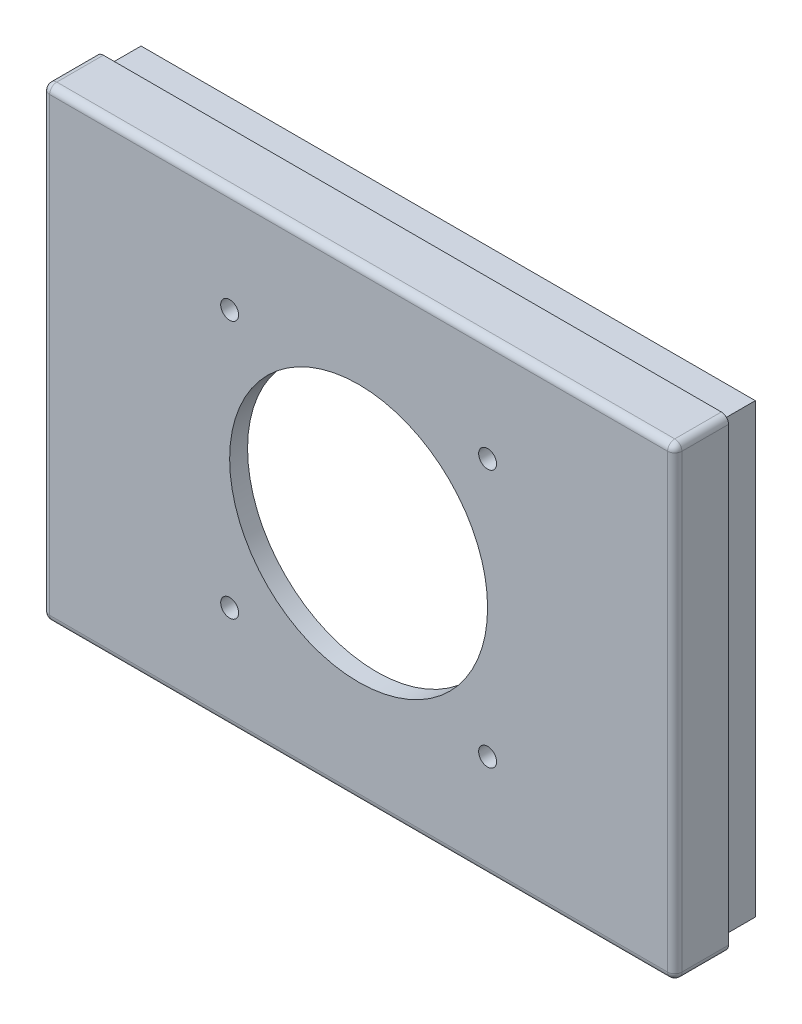
ISO-10303-21;
HEADER;
FILE_DESCRIPTION(('STEP AP214'),'2;1');
FILE_NAME('part.step','',(''),(''),'','','');
FILE_SCHEMA(('AUTOMOTIVE_DESIGN { 1 0 10303 214 1 1 1 1 }'));
ENDSEC;
DATA;
#1=APPLICATION_CONTEXT('core data for automotive mechanical design processes');
#2=APPLICATION_PROTOCOL_DEFINITION('international standard','automotive_design',2000,#1);
#3=PRODUCT_CONTEXT('',#1,'mechanical');
#4=PRODUCT('Part','Part','',(#3));
#5=PRODUCT_RELATED_PRODUCT_CATEGORY('part','',(#4));
#6=PRODUCT_DEFINITION_FORMATION('','',#4);
#7=PRODUCT_DEFINITION_CONTEXT('part definition',#1,'design');
#8=PRODUCT_DEFINITION('design','',#6,#7);
#9=PRODUCT_DEFINITION_SHAPE('','',#8);
#10=(LENGTH_UNIT() NAMED_UNIT(*) SI_UNIT(.MILLI.,.METRE.));
#11=(NAMED_UNIT(*) PLANE_ANGLE_UNIT() SI_UNIT($,.RADIAN.));
#12=(NAMED_UNIT(*) SI_UNIT($,.STERADIAN.) SOLID_ANGLE_UNIT());
#13=UNCERTAINTY_MEASURE_WITH_UNIT(LENGTH_MEASURE(1.E-05),#10,'distance_accuracy_value','');
#14=(GEOMETRIC_REPRESENTATION_CONTEXT(3) GLOBAL_UNCERTAINTY_ASSIGNED_CONTEXT((#13)) GLOBAL_UNIT_ASSIGNED_CONTEXT((#10,
#11,#12)) REPRESENTATION_CONTEXT('',''));
#15=CARTESIAN_POINT('',(0.,0.,0.));
#16=DIRECTION('',(0.,0.,1.));
#17=DIRECTION('',(1.,0.,0.));
#18=AXIS2_PLACEMENT_3D('',#15,#16,#17);
#19=CARTESIAN_POINT('',(0.,0.,10.));
#20=DIRECTION('',(0.,0.,1.));
#21=DIRECTION('',(1.,0.,0.));
#22=AXIS2_PLACEMENT_3D('',#19,#20,#21);
#23=PLANE('',#22);
#24=DIRECTION('',(0.,-1.,0.));
#25=VECTOR('',#24,1.);
#26=CARTESIAN_POINT('',(146.492,99.883,10.));
#27=LINE('',#26,#25);
#28=CARTESIAN_POINT('',(146.492,99.883,10.));
#29=VERTEX_POINT('',#28);
#30=CARTESIAN_POINT('',(146.492,-20.,10.));
#31=VERTEX_POINT('',#30);
#32=EDGE_CURVE('E235',#29,#31,#27,.T.);
#33=ORIENTED_EDGE('',*,*,#32,.F.);
#34=DIRECTION('',(1.,0.,0.));
#35=VECTOR('',#34,1.);
#36=CARTESIAN_POINT('',(146.492,99.883,10.));
#37=LINE('',#36,#35);
#38=CARTESIAN_POINT('',(-20.,99.883,10.));
#39=VERTEX_POINT('',#38);
#40=EDGE_CURVE('E219',#39,#29,#37,.T.);
#41=ORIENTED_EDGE('',*,*,#40,.F.);
#42=DIRECTION('',(0.,1.,0.));
#43=VECTOR('',#42,1.);
#44=CARTESIAN_POINT('',(-20.,99.883,10.));
#45=LINE('',#44,#43);
#46=CARTESIAN_POINT('',(-20.,-20.,10.));
#47=VERTEX_POINT('',#46);
#48=EDGE_CURVE('E224',#47,#39,#45,.T.);
#49=ORIENTED_EDGE('',*,*,#48,.F.);
#50=DIRECTION('',(-1.,0.,0.));
#51=VECTOR('',#50,1.);
#52=CARTESIAN_POINT('',(146.492,-20.,10.));
#53=LINE('',#52,#51);
#54=EDGE_CURVE('E238',#31,#47,#53,.T.);
#55=ORIENTED_EDGE('',*,*,#54,.F.);
#56=EDGE_LOOP('',(#33,#41,#49,#55));
#57=FACE_BOUND('',#56,.T.);
#58=DIRECTION('',(1.,0.,0.));
#59=VECTOR('',#58,1.);
#60=CARTESIAN_POINT('',(148.972,102.363,10.));
#61=LINE('',#60,#59);
#62=CARTESIAN_POINT('',(-22.48,102.363,10.));
#63=VERTEX_POINT('',#62);
#64=CARTESIAN_POINT('',(148.972,102.363,10.));
#65=VERTEX_POINT('',#64);
#66=EDGE_CURVE('E198',#63,#65,#61,.T.);
#67=ORIENTED_EDGE('',*,*,#66,.T.);
#68=DIRECTION('',(0.,-1.,0.));
#69=VECTOR('',#68,1.);
#70=CARTESIAN_POINT('',(148.972,102.363,10.));
#71=LINE('',#70,#69);
#72=CARTESIAN_POINT('',(148.972,-22.48,10.));
#73=VERTEX_POINT('',#72);
#74=EDGE_CURVE('E166',#65,#73,#71,.T.);
#75=ORIENTED_EDGE('',*,*,#74,.T.);
#76=DIRECTION('',(-1.,0.,0.));
#77=VECTOR('',#76,1.);
#78=CARTESIAN_POINT('',(148.972,-22.48,10.));
#79=LINE('',#78,#77);
#80=CARTESIAN_POINT('',(-22.48,-22.48,10.));
#81=VERTEX_POINT('',#80);
#82=EDGE_CURVE('E190',#73,#81,#79,.T.);
#83=ORIENTED_EDGE('',*,*,#82,.T.);
#84=DIRECTION('',(0.,1.,0.));
#85=VECTOR('',#84,1.);
#86=CARTESIAN_POINT('',(-22.48,102.363,10.));
#87=LINE('',#86,#85);
#88=EDGE_CURVE('E187',#81,#63,#87,.T.);
#89=ORIENTED_EDGE('',*,*,#88,.T.);
#90=EDGE_LOOP('',(#67,#75,#83,#89));
#91=FACE_BOUND('',#90,.T.);
#92=ADVANCED_FACE('F37',(#57,#91),#23,.F.);
#93=CARTESIAN_POINT('',(146.492,99.883,30.));
#94=DIRECTION('',(0.,1.,0.));
#95=DIRECTION('',(0.,0.,1.));
#96=AXIS2_PLACEMENT_3D('',#93,#94,#95);
#97=PLANE('',#96);
#98=ORIENTED_EDGE('',*,*,#40,.T.);
#99=DIRECTION('',(0.,0.,-1.));
#100=VECTOR('',#99,1.);
#101=CARTESIAN_POINT('',(146.492,99.883,30.));
#102=LINE('',#101,#100);
#103=CARTESIAN_POINT('',(146.492,99.883,30.));
#104=VERTEX_POINT('',#103);
#105=EDGE_CURVE('E233',#104,#29,#102,.T.);
#106=ORIENTED_EDGE('',*,*,#105,.F.);
#107=DIRECTION('',(1.,0.,0.));
#108=VECTOR('',#107,1.);
#109=CARTESIAN_POINT('',(146.492,99.883,30.));
#110=LINE('',#109,#108);
#111=CARTESIAN_POINT('',(-20.,99.883,30.));
#112=VERTEX_POINT('',#111);
#113=EDGE_CURVE('E220',#112,#104,#110,.T.);
#114=ORIENTED_EDGE('',*,*,#113,.F.);
#115=DIRECTION('',(0.,0.,-1.));
#116=VECTOR('',#115,1.);
#117=CARTESIAN_POINT('',(-20.,99.883,30.));
#118=LINE('',#117,#116);
#119=EDGE_CURVE('E243',#112,#39,#118,.T.);
#120=ORIENTED_EDGE('',*,*,#119,.T.);
#121=EDGE_LOOP('',(#98,#106,#114,#120));
#122=FACE_BOUND('',#121,.T.);
#123=ADVANCED_FACE('F377',(#122),#97,.F.);
#124=CARTESIAN_POINT('',(-20.,99.883,30.));
#125=DIRECTION('',(-1.,0.,0.));
#126=DIRECTION('',(0.,-1.,0.));
#127=AXIS2_PLACEMENT_3D('',#124,#125,#126);
#128=PLANE('',#127);
#129=ORIENTED_EDGE('',*,*,#48,.T.);
#130=ORIENTED_EDGE('',*,*,#119,.F.);
#131=DIRECTION('',(0.,1.,0.));
#132=VECTOR('',#131,1.);
#133=CARTESIAN_POINT('',(-20.,99.883,30.));
#134=LINE('',#133,#132);
#135=CARTESIAN_POINT('',(-20.,-20.,30.));
#136=VERTEX_POINT('',#135);
#137=EDGE_CURVE('E230',#136,#112,#134,.T.);
#138=ORIENTED_EDGE('',*,*,#137,.F.);
#139=DIRECTION('',(0.,0.,-1.));
#140=VECTOR('',#139,1.);
#141=CARTESIAN_POINT('',(-20.,-20.,30.));
#142=LINE('',#141,#140);
#143=EDGE_CURVE('E246',#136,#47,#142,.T.);
#144=ORIENTED_EDGE('',*,*,#143,.T.);
#145=EDGE_LOOP('',(#129,#130,#138,#144));
#146=FACE_BOUND('',#145,.T.);
#147=ADVANCED_FACE('F385',(#146),#128,.F.);
#148=CARTESIAN_POINT('',(146.492,-20.,30.));
#149=DIRECTION('',(0.,-1.,0.));
#150=DIRECTION('',(1.,0.,0.));
#151=AXIS2_PLACEMENT_3D('',#148,#149,#150);
#152=PLANE('',#151);
#153=ORIENTED_EDGE('',*,*,#54,.T.);
#154=ORIENTED_EDGE('',*,*,#143,.F.);
#155=DIRECTION('',(-1.,0.,0.));
#156=VECTOR('',#155,1.);
#157=CARTESIAN_POINT('',(146.492,-20.,30.));
#158=LINE('',#157,#156);
#159=CARTESIAN_POINT('',(146.492,-20.,30.));
#160=VERTEX_POINT('',#159);
#161=EDGE_CURVE('E227',#160,#136,#158,.T.);
#162=ORIENTED_EDGE('',*,*,#161,.F.);
#163=DIRECTION('',(0.,0.,-1.));
#164=VECTOR('',#163,1.);
#165=CARTESIAN_POINT('',(146.492,-20.,30.));
#166=LINE('',#165,#164);
#167=EDGE_CURVE('E248',#160,#31,#166,.T.);
#168=ORIENTED_EDGE('',*,*,#167,.T.);
#169=EDGE_LOOP('',(#153,#154,#162,#168));
#170=FACE_BOUND('',#169,.T.);
#171=ADVANCED_FACE('F501',(#170),#152,.F.);
#172=CARTESIAN_POINT('',(146.492,99.883,30.));
#173=DIRECTION('',(1.,0.,0.));
#174=DIRECTION('',(0.,0.,-1.));
#175=AXIS2_PLACEMENT_3D('',#172,#173,#174);
#176=PLANE('',#175);
#177=ORIENTED_EDGE('',*,*,#32,.T.);
#178=ORIENTED_EDGE('',*,*,#167,.F.);
#179=DIRECTION('',(0.,-1.,0.));
#180=VECTOR('',#179,1.);
#181=CARTESIAN_POINT('',(146.492,99.883,30.));
#182=LINE('',#181,#180);
#183=EDGE_CURVE('E223',#104,#160,#182,.T.);
#184=ORIENTED_EDGE('',*,*,#183,.F.);
#185=ORIENTED_EDGE('',*,*,#105,.T.);
#186=EDGE_LOOP('',(#177,#178,#184,#185));
#187=FACE_BOUND('',#186,.T.);
#188=ADVANCED_FACE('F493',(#187),#176,.F.);
#189=CARTESIAN_POINT('',(0.,0.,30.));
#190=DIRECTION('',(0.,0.,1.));
#191=DIRECTION('',(1.,0.,0.));
#192=AXIS2_PLACEMENT_3D('',#189,#190,#191);
#193=PLANE('',#192);
#194=CARTESIAN_POINT('',(27.2460000000007,3.94150000000001,30.));
#195=DIRECTION('',(0.,0.,1.));
#196=DIRECTION('',(1.,0.,0.));
#197=AXIS2_PLACEMENT_3D('',#194,#195,#196);
#198=CIRCLE('',#197,2.5);
#199=CARTESIAN_POINT('',(29.7460000000007,3.94150000000001,30.));
#200=VERTEX_POINT('',#199);
#201=EDGE_CURVE('E347',#200,#200,#198,.T.);
#202=ORIENTED_EDGE('',*,*,#201,.T.);
#203=EDGE_LOOP('',(#202));
#204=FACE_BOUND('',#203,.T.);
#205=CARTESIAN_POINT('',(99.2460000000007,3.94150000000101,30.));
#206=DIRECTION('',(0.,0.,1.));
#207=DIRECTION('',(1.,0.,0.));
#208=AXIS2_PLACEMENT_3D('',#205,#206,#207);
#209=CIRCLE('',#208,2.5);
#210=CARTESIAN_POINT('',(101.746000000001,3.94150000000101,30.));
#211=VERTEX_POINT('',#210);
#212=EDGE_CURVE('E344',#211,#211,#209,.T.);
#213=ORIENTED_EDGE('',*,*,#212,.T.);
#214=EDGE_LOOP('',(#213));
#215=FACE_BOUND('',#214,.T.);
#216=CARTESIAN_POINT('',(99.246,75.941500000001,30.));
#217=DIRECTION('',(0.,0.,1.));
#218=DIRECTION('',(1.,0.,0.));
#219=AXIS2_PLACEMENT_3D('',#216,#217,#218);
#220=CIRCLE('',#219,2.5);
#221=CARTESIAN_POINT('',(101.746,75.941500000001,30.));
#222=VERTEX_POINT('',#221);
#223=EDGE_CURVE('E341',#222,#222,#220,.T.);
#224=ORIENTED_EDGE('',*,*,#223,.T.);
#225=EDGE_LOOP('',(#224));
#226=FACE_BOUND('',#225,.T.);
#227=CARTESIAN_POINT('',(27.246,75.9415,30.));
#228=DIRECTION('',(0.,0.,1.));
#229=DIRECTION('',(1.,0.,0.));
#230=AXIS2_PLACEMENT_3D('',#227,#228,#229);
#231=CIRCLE('',#230,2.5);
#232=CARTESIAN_POINT('',(29.746,75.9415,30.));
#233=VERTEX_POINT('',#232);
#234=EDGE_CURVE('E338',#233,#233,#231,.T.);
#235=ORIENTED_EDGE('',*,*,#234,.T.);
#236=EDGE_LOOP('',(#235));
#237=FACE_BOUND('',#236,.T.);
#238=CARTESIAN_POINT('',(63.246,39.9415,30.));
#239=DIRECTION('',(0.,0.,1.));
#240=DIRECTION('',(1.,0.,0.));
#241=AXIS2_PLACEMENT_3D('',#238,#239,#240);
#242=CIRCLE('',#241,36.);
#243=CARTESIAN_POINT('',(99.246,39.9415,30.));
#244=VERTEX_POINT('',#243);
#245=EDGE_CURVE('E193',#244,#244,#242,.T.);
#246=ORIENTED_EDGE('',*,*,#245,.T.);
#247=EDGE_LOOP('',(#246));
#248=FACE_BOUND('',#247,.T.);
#249=ORIENTED_EDGE('',*,*,#113,.T.);
#250=ORIENTED_EDGE('',*,*,#183,.T.);
#251=ORIENTED_EDGE('',*,*,#161,.T.);
#252=ORIENTED_EDGE('',*,*,#137,.T.);
#253=EDGE_LOOP('',(#249,#250,#251,#252));
#254=FACE_BOUND('',#253,.T.);
#255=ADVANCED_FACE('F356',(#204,#215,#226,#237,#248,#254),#193,.F.);
#256=CARTESIAN_POINT('',(0.,0.,20.));
#257=DIRECTION('',(0.,0.,-1.));
#258=DIRECTION('',(-1.,0.,0.));
#259=AXIS2_PLACEMENT_3D('',#256,#257,#258);
#260=PLANE('',#259);
#261=DIRECTION('',(0.,1.,0.));
#262=VECTOR('',#261,1.);
#263=CARTESIAN_POINT('',(-22.48,102.363,20.));
#264=LINE('',#263,#262);
#265=CARTESIAN_POINT('',(-22.48,-22.48,20.));
#266=VERTEX_POINT('',#265);
#267=CARTESIAN_POINT('',(-22.48,102.363,20.));
#268=VERTEX_POINT('',#267);
#269=EDGE_CURVE('E172',#266,#268,#264,.T.);
#270=ORIENTED_EDGE('',*,*,#269,.F.);
#271=DIRECTION('',(-1.,0.,0.));
#272=VECTOR('',#271,1.);
#273=CARTESIAN_POINT('',(148.972,-22.48,20.));
#274=LINE('',#273,#272);
#275=CARTESIAN_POINT('',(148.972,-22.48,20.));
#276=VERTEX_POINT('',#275);
#277=EDGE_CURVE('E182',#276,#266,#274,.T.);
#278=ORIENTED_EDGE('',*,*,#277,.F.);
#279=DIRECTION('',(0.,-1.,0.));
#280=VECTOR('',#279,1.);
#281=CARTESIAN_POINT('',(148.972,102.363,20.));
#282=LINE('',#281,#280);
#283=CARTESIAN_POINT('',(148.972,102.363,20.));
#284=VERTEX_POINT('',#283);
#285=EDGE_CURVE('E164',#284,#276,#282,.T.);
#286=ORIENTED_EDGE('',*,*,#285,.F.);
#287=DIRECTION('',(1.,0.,0.));
#288=VECTOR('',#287,1.);
#289=CARTESIAN_POINT('',(148.972,102.363,20.));
#290=LINE('',#289,#288);
#291=EDGE_CURVE('E179',#268,#284,#290,.T.);
#292=ORIENTED_EDGE('',*,*,#291,.F.);
#293=EDGE_LOOP('',(#270,#278,#286,#292));
#294=FACE_BOUND('',#293,.T.);
#295=DIRECTION('',(0.,1.,0.));
#296=VECTOR('',#295,1.);
#297=CARTESIAN_POINT('',(-25.,104.883,20.));
#298=LINE('',#297,#296);
#299=CARTESIAN_POINT('',(-25.,-23.,20.));
#300=VERTEX_POINT('',#299);
#301=CARTESIAN_POINT('',(-25.,102.883,20.));
#302=VERTEX_POINT('',#301);
#303=EDGE_CURVE('E213',#300,#302,#298,.T.);
#304=ORIENTED_EDGE('',*,*,#303,.T.);
#305=CARTESIAN_POINT('',(-23.,102.883,20.));
#306=DIRECTION('',(0.,0.,-1.));
#307=DIRECTION('',(-1.,0.,0.));
#308=AXIS2_PLACEMENT_3D('',#305,#306,#307);
#309=CIRCLE('',#308,2.);
#310=CARTESIAN_POINT('',(-23.,104.883,20.));
#311=VERTEX_POINT('',#310);
#312=EDGE_CURVE('E279',#302,#311,#309,.T.);
#313=ORIENTED_EDGE('',*,*,#312,.T.);
#314=DIRECTION('',(1.,0.,0.));
#315=VECTOR('',#314,1.);
#316=CARTESIAN_POINT('',(151.492,104.883,20.));
#317=LINE('',#316,#315);
#318=CARTESIAN_POINT('',(149.492,104.883,20.));
#319=VERTEX_POINT('',#318);
#320=EDGE_CURVE('E216',#311,#319,#317,.T.);
#321=ORIENTED_EDGE('',*,*,#320,.T.);
#322=CARTESIAN_POINT('',(149.492,102.883,20.));
#323=DIRECTION('',(0.,0.,-1.));
#324=DIRECTION('',(-1.,0.,0.));
#325=AXIS2_PLACEMENT_3D('',#322,#323,#324);
#326=CIRCLE('',#325,2.);
#327=CARTESIAN_POINT('',(151.492,102.883,20.));
#328=VERTEX_POINT('',#327);
#329=EDGE_CURVE('E277',#319,#328,#326,.T.);
#330=ORIENTED_EDGE('',*,*,#329,.T.);
#331=DIRECTION('',(0.,-1.,0.));
#332=VECTOR('',#331,1.);
#333=CARTESIAN_POINT('',(151.492,104.883,20.));
#334=LINE('',#333,#332);
#335=CARTESIAN_POINT('',(151.492,-23.,20.));
#336=VERTEX_POINT('',#335);
#337=EDGE_CURVE('E204',#328,#336,#334,.T.);
#338=ORIENTED_EDGE('',*,*,#337,.T.);
#339=CARTESIAN_POINT('',(149.492,-23.,20.));
#340=DIRECTION('',(0.,0.,-1.));
#341=DIRECTION('',(-1.,0.,0.));
#342=AXIS2_PLACEMENT_3D('',#339,#340,#341);
#343=CIRCLE('',#342,2.);
#344=CARTESIAN_POINT('',(149.492,-25.,20.));
#345=VERTEX_POINT('',#344);
#346=EDGE_CURVE('E275',#336,#345,#343,.T.);
#347=ORIENTED_EDGE('',*,*,#346,.T.);
#348=DIRECTION('',(-1.,0.,0.));
#349=VECTOR('',#348,1.);
#350=CARTESIAN_POINT('',(151.492,-25.,20.));
#351=LINE('',#350,#349);
#352=CARTESIAN_POINT('',(-23.,-25.,20.));
#353=VERTEX_POINT('',#352);
#354=EDGE_CURVE('E210',#345,#353,#351,.T.);
#355=ORIENTED_EDGE('',*,*,#354,.T.);
#356=CARTESIAN_POINT('',(-23.,-23.,20.));
#357=DIRECTION('',(0.,0.,-1.));
#358=DIRECTION('',(-1.,0.,0.));
#359=AXIS2_PLACEMENT_3D('',#356,#357,#358);
#360=CIRCLE('',#359,2.);
#361=EDGE_CURVE('E273',#353,#300,#360,.T.);
#362=ORIENTED_EDGE('',*,*,#361,.T.);
#363=EDGE_LOOP('',(#304,#313,#321,#330,#338,#347,#355,#362));
#364=FACE_BOUND('',#363,.T.);
#365=ADVANCED_FACE('F177',(#294,#364),#260,.T.);
#366=CARTESIAN_POINT('',(148.972,102.363,20.));
#367=DIRECTION('',(0.,1.,0.));
#368=DIRECTION('',(0.,0.,1.));
#369=AXIS2_PLACEMENT_3D('',#366,#367,#368);
#370=PLANE('',#369);
#371=ORIENTED_EDGE('',*,*,#66,.F.);
#372=DIRECTION('',(0.,0.,-1.));
#373=VECTOR('',#372,1.);
#374=CARTESIAN_POINT('',(-22.48,102.363,20.));
#375=LINE('',#374,#373);
#376=EDGE_CURVE('E186',#268,#63,#375,.T.);
#377=ORIENTED_EDGE('',*,*,#376,.F.);
#378=ORIENTED_EDGE('',*,*,#291,.T.);
#379=DIRECTION('',(0.,0.,-1.));
#380=VECTOR('',#379,1.);
#381=CARTESIAN_POINT('',(148.972,102.363,20.));
#382=LINE('',#381,#380);
#383=EDGE_CURVE('E160',#284,#65,#382,.T.);
#384=ORIENTED_EDGE('',*,*,#383,.T.);
#385=EDGE_LOOP('',(#371,#377,#378,#384));
#386=FACE_BOUND('',#385,.T.);
#387=ADVANCED_FACE('F185',(#386),#370,.T.);
#388=CARTESIAN_POINT('',(-22.48,102.363,20.));
#389=DIRECTION('',(-1.,0.,0.));
#390=DIRECTION('',(0.,0.,1.));
#391=AXIS2_PLACEMENT_3D('',#388,#389,#390);
#392=PLANE('',#391);
#393=ORIENTED_EDGE('',*,*,#88,.F.);
#394=DIRECTION('',(0.,0.,-1.));
#395=VECTOR('',#394,1.);
#396=CARTESIAN_POINT('',(-22.48,-22.48,20.));
#397=LINE('',#396,#395);
#398=EDGE_CURVE('E205',#266,#81,#397,.T.);
#399=ORIENTED_EDGE('',*,*,#398,.F.);
#400=ORIENTED_EDGE('',*,*,#269,.T.);
#401=ORIENTED_EDGE('',*,*,#376,.T.);
#402=EDGE_LOOP('',(#393,#399,#400,#401));
#403=FACE_BOUND('',#402,.T.);
#404=ADVANCED_FACE('F579',(#403),#392,.T.);
#405=CARTESIAN_POINT('',(148.972,-22.48,20.));
#406=DIRECTION('',(0.,-1.,0.));
#407=DIRECTION('',(1.,0.,0.));
#408=AXIS2_PLACEMENT_3D('',#405,#406,#407);
#409=PLANE('',#408);
#410=ORIENTED_EDGE('',*,*,#82,.F.);
#411=DIRECTION('',(0.,0.,-1.));
#412=VECTOR('',#411,1.);
#413=CARTESIAN_POINT('',(148.972,-22.48,20.));
#414=LINE('',#413,#412);
#415=EDGE_CURVE('E171',#276,#73,#414,.T.);
#416=ORIENTED_EDGE('',*,*,#415,.F.);
#417=ORIENTED_EDGE('',*,*,#277,.T.);
#418=ORIENTED_EDGE('',*,*,#398,.T.);
#419=EDGE_LOOP('',(#410,#416,#417,#418));
#420=FACE_BOUND('',#419,.T.);
#421=ADVANCED_FACE('F586',(#420),#409,.T.);
#422=CARTESIAN_POINT('',(148.972,102.363,20.));
#423=DIRECTION('',(1.,0.,0.));
#424=DIRECTION('',(0.,0.,-1.));
#425=AXIS2_PLACEMENT_3D('',#422,#423,#424);
#426=PLANE('',#425);
#427=ORIENTED_EDGE('',*,*,#74,.F.);
#428=ORIENTED_EDGE('',*,*,#383,.F.);
#429=ORIENTED_EDGE('',*,*,#285,.T.);
#430=ORIENTED_EDGE('',*,*,#415,.T.);
#431=EDGE_LOOP('',(#427,#428,#429,#430));
#432=FACE_BOUND('',#431,.T.);
#433=ADVANCED_FACE('F162',(#432),#426,.T.);
#434=CARTESIAN_POINT('',(0.,0.,35.));
#435=DIRECTION('',(0.,0.,1.));
#436=DIRECTION('',(1.,0.,0.));
#437=AXIS2_PLACEMENT_3D('',#434,#435,#436);
#438=PLANE('',#437);
#439=DIRECTION('',(0.,1.,0.));
#440=VECTOR('',#439,1.);
#441=CARTESIAN_POINT('',(149.492,104.883,35.));
#442=LINE('',#441,#440);
#443=CARTESIAN_POINT('',(149.492,-23.,35.));
#444=VERTEX_POINT('',#443);
#445=CARTESIAN_POINT('',(149.492,102.883,35.));
#446=VERTEX_POINT('',#445);
#447=EDGE_CURVE('E253',#444,#446,#442,.T.);
#448=ORIENTED_EDGE('',*,*,#447,.T.);
#449=DIRECTION('',(-1.,0.,0.));
#450=VECTOR('',#449,1.);
#451=CARTESIAN_POINT('',(-25.,102.883,35.));
#452=LINE('',#451,#450);
#453=CARTESIAN_POINT('',(-23.,102.883,35.));
#454=VERTEX_POINT('',#453);
#455=EDGE_CURVE('E257',#446,#454,#452,.T.);
#456=ORIENTED_EDGE('',*,*,#455,.T.);
#457=DIRECTION('',(0.,-1.,0.));
#458=VECTOR('',#457,1.);
#459=CARTESIAN_POINT('',(-23.,-25.,35.));
#460=LINE('',#459,#458);
#461=CARTESIAN_POINT('',(-23.,-23.,35.));
#462=VERTEX_POINT('',#461);
#463=EDGE_CURVE('E255',#454,#462,#460,.T.);
#464=ORIENTED_EDGE('',*,*,#463,.T.);
#465=DIRECTION('',(1.,0.,0.));
#466=VECTOR('',#465,1.);
#467=CARTESIAN_POINT('',(151.492,-23.,35.));
#468=LINE('',#467,#466);
#469=EDGE_CURVE('E245',#462,#444,#468,.T.);
#470=ORIENTED_EDGE('',*,*,#469,.T.);
#471=EDGE_LOOP('',(#448,#456,#464,#470));
#472=FACE_BOUND('',#471,.T.);
#473=CARTESIAN_POINT('',(27.2460000000007,3.94150000000001,35.));
#474=DIRECTION('',(0.,0.,1.));
#475=DIRECTION('',(1.,0.,0.));
#476=AXIS2_PLACEMENT_3D('',#473,#474,#475);
#477=CIRCLE('',#476,2.5);
#478=CARTESIAN_POINT('',(29.7460000000007,3.94150000000001,35.));
#479=VERTEX_POINT('',#478);
#480=EDGE_CURVE('E323',#479,#479,#477,.T.);
#481=ORIENTED_EDGE('',*,*,#480,.F.);
#482=EDGE_LOOP('',(#481));
#483=FACE_BOUND('',#482,.T.);
#484=CARTESIAN_POINT('',(99.2460000000007,3.94150000000101,35.));
#485=DIRECTION('',(0.,0.,1.));
#486=DIRECTION('',(1.,0.,0.));
#487=AXIS2_PLACEMENT_3D('',#484,#485,#486);
#488=CIRCLE('',#487,2.5);
#489=CARTESIAN_POINT('',(101.746000000001,3.94150000000101,35.));
#490=VERTEX_POINT('',#489);
#491=EDGE_CURVE('E326',#490,#490,#488,.T.);
#492=ORIENTED_EDGE('',*,*,#491,.F.);
#493=EDGE_LOOP('',(#492));
#494=FACE_BOUND('',#493,.T.);
#495=CARTESIAN_POINT('',(99.246,75.941500000001,35.));
#496=DIRECTION('',(0.,0.,1.));
#497=DIRECTION('',(1.,0.,0.));
#498=AXIS2_PLACEMENT_3D('',#495,#496,#497);
#499=CIRCLE('',#498,2.5);
#500=CARTESIAN_POINT('',(101.746,75.941500000001,35.));
#501=VERTEX_POINT('',#500);
#502=EDGE_CURVE('E331',#501,#501,#499,.T.);
#503=ORIENTED_EDGE('',*,*,#502,.F.);
#504=EDGE_LOOP('',(#503));
#505=FACE_BOUND('',#504,.T.);
#506=CARTESIAN_POINT('',(27.246,75.9415,35.));
#507=DIRECTION('',(0.,0.,1.));
#508=DIRECTION('',(1.,0.,0.));
#509=AXIS2_PLACEMENT_3D('',#506,#507,#508);
#510=CIRCLE('',#509,2.5);
#511=CARTESIAN_POINT('',(29.746,75.9415,35.));
#512=VERTEX_POINT('',#511);
#513=EDGE_CURVE('E335',#512,#512,#510,.T.);
#514=ORIENTED_EDGE('',*,*,#513,.F.);
#515=EDGE_LOOP('',(#514));
#516=FACE_BOUND('',#515,.T.);
#517=CARTESIAN_POINT('',(63.246,39.9415,35.));
#518=DIRECTION('',(0.,0.,1.));
#519=DIRECTION('',(1.,0.,0.));
#520=AXIS2_PLACEMENT_3D('',#517,#518,#519);
#521=CIRCLE('',#520,36.);
#522=CARTESIAN_POINT('',(99.246,39.9415,35.));
#523=VERTEX_POINT('',#522);
#524=EDGE_CURVE('E349',#523,#523,#521,.T.);
#525=ORIENTED_EDGE('',*,*,#524,.F.);
#526=EDGE_LOOP('',(#525));
#527=FACE_BOUND('',#526,.T.);
#528=ADVANCED_FACE('F392',(#472,#483,#494,#505,#516,#527),#438,.T.);
#529=CARTESIAN_POINT('',(-25.,104.883,35.));
#530=DIRECTION('',(0.,-1.,0.));
#531=DIRECTION('',(0.,0.,-1.));
#532=AXIS2_PLACEMENT_3D('',#529,#530,#531);
#533=PLANE('',#532);
#534=ORIENTED_EDGE('',*,*,#320,.F.);
#535=DIRECTION('',(0.,0.,-1.));
#536=VECTOR('',#535,1.);
#537=CARTESIAN_POINT('',(-23.,104.883,35.));
#538=LINE('',#537,#536);
#539=CARTESIAN_POINT('',(-23.,104.883,33.));
#540=VERTEX_POINT('',#539);
#541=EDGE_CURVE('E265',#311,#540,#538,.F.);
#542=ORIENTED_EDGE('',*,*,#541,.T.);
#543=DIRECTION('',(-1.,0.,0.));
#544=VECTOR('',#543,1.);
#545=CARTESIAN_POINT('',(151.492,104.883,33.));
#546=LINE('',#545,#544);
#547=CARTESIAN_POINT('',(149.492,104.883,33.));
#548=VERTEX_POINT('',#547);
#549=EDGE_CURVE('E262',#540,#548,#546,.F.);
#550=ORIENTED_EDGE('',*,*,#549,.T.);
#551=DIRECTION('',(0.,0.,-1.));
#552=VECTOR('',#551,1.);
#553=CARTESIAN_POINT('',(149.492,104.883,35.));
#554=LINE('',#553,#552);
#555=EDGE_CURVE('E260',#548,#319,#554,.T.);
#556=ORIENTED_EDGE('',*,*,#555,.T.);
#557=EDGE_LOOP('',(#534,#542,#550,#556));
#558=FACE_BOUND('',#557,.T.);
#559=ADVANCED_FACE('F393',(#558),#533,.F.);
#560=CARTESIAN_POINT('',(151.492,104.883,35.));
#561=DIRECTION('',(-1.,0.,0.));
#562=DIRECTION('',(0.,0.,1.));
#563=AXIS2_PLACEMENT_3D('',#560,#561,#562);
#564=PLANE('',#563);
#565=ORIENTED_EDGE('',*,*,#337,.F.);
#566=DIRECTION('',(0.,0.,-1.));
#567=VECTOR('',#566,1.);
#568=CARTESIAN_POINT('',(151.492,102.883,35.));
#569=LINE('',#568,#567);
#570=CARTESIAN_POINT('',(151.492,102.883,33.));
#571=VERTEX_POINT('',#570);
#572=EDGE_CURVE('E285',#328,#571,#569,.F.);
#573=ORIENTED_EDGE('',*,*,#572,.T.);
#574=DIRECTION('',(0.,1.,0.));
#575=VECTOR('',#574,1.);
#576=CARTESIAN_POINT('',(151.492,-25.,33.));
#577=LINE('',#576,#575);
#578=CARTESIAN_POINT('',(151.492,-23.,33.));
#579=VERTEX_POINT('',#578);
#580=EDGE_CURVE('E283',#571,#579,#577,.F.);
#581=ORIENTED_EDGE('',*,*,#580,.T.);
#582=DIRECTION('',(0.,0.,-1.));
#583=VECTOR('',#582,1.);
#584=CARTESIAN_POINT('',(151.492,-23.,35.));
#585=LINE('',#584,#583);
#586=EDGE_CURVE('E281',#579,#336,#585,.T.);
#587=ORIENTED_EDGE('',*,*,#586,.T.);
#588=EDGE_LOOP('',(#565,#573,#581,#587));
#589=FACE_BOUND('',#588,.T.);
#590=ADVANCED_FACE('F396',(#589),#564,.F.);
#591=CARTESIAN_POINT('',(-25.,-25.,35.));
#592=DIRECTION('',(0.,1.,0.));
#593=DIRECTION('',(0.,0.,1.));
#594=AXIS2_PLACEMENT_3D('',#591,#592,#593);
#595=PLANE('',#594);
#596=ORIENTED_EDGE('',*,*,#354,.F.);
#597=DIRECTION('',(0.,0.,-1.));
#598=VECTOR('',#597,1.);
#599=CARTESIAN_POINT('',(149.492,-25.,35.));
#600=LINE('',#599,#598);
#601=CARTESIAN_POINT('',(149.492,-25.,33.));
#602=VERTEX_POINT('',#601);
#603=EDGE_CURVE('E12',#345,#602,#600,.F.);
#604=ORIENTED_EDGE('',*,*,#603,.T.);
#605=DIRECTION('',(1.,0.,0.));
#606=VECTOR('',#605,1.);
#607=CARTESIAN_POINT('',(-25.,-25.,33.));
#608=LINE('',#607,#606);
#609=CARTESIAN_POINT('',(-23.,-25.,33.));
#610=VERTEX_POINT('',#609);
#611=EDGE_CURVE('E46',#602,#610,#608,.F.);
#612=ORIENTED_EDGE('',*,*,#611,.T.);
#613=DIRECTION('',(0.,0.,-1.));
#614=VECTOR('',#613,1.);
#615=CARTESIAN_POINT('',(-23.,-25.,35.));
#616=LINE('',#615,#614);
#617=EDGE_CURVE('E287',#610,#353,#616,.T.);
#618=ORIENTED_EDGE('',*,*,#617,.T.);
#619=EDGE_LOOP('',(#596,#604,#612,#618));
#620=FACE_BOUND('',#619,.T.);
#621=ADVANCED_FACE('F372',(#620),#595,.F.);
#622=CARTESIAN_POINT('',(-25.,104.883,35.));
#623=DIRECTION('',(1.,0.,0.));
#624=DIRECTION('',(0.,0.,-1.));
#625=AXIS2_PLACEMENT_3D('',#622,#623,#624);
#626=PLANE('',#625);
#627=DIRECTION('',(0.,-1.,0.));
#628=VECTOR('',#627,1.);
#629=CARTESIAN_POINT('',(-25.,104.883,33.));
#630=LINE('',#629,#628);
#631=CARTESIAN_POINT('',(-25.,-23.,33.));
#632=VERTEX_POINT('',#631);
#633=CARTESIAN_POINT('',(-25.,102.883,33.));
#634=VERTEX_POINT('',#633);
#635=EDGE_CURVE('E269',#632,#634,#630,.F.);
#636=ORIENTED_EDGE('',*,*,#635,.T.);
#637=DIRECTION('',(0.,0.,-1.));
#638=VECTOR('',#637,1.);
#639=CARTESIAN_POINT('',(-25.,102.883,35.));
#640=LINE('',#639,#638);
#641=EDGE_CURVE('E271',#634,#302,#640,.T.);
#642=ORIENTED_EDGE('',*,*,#641,.T.);
#643=ORIENTED_EDGE('',*,*,#303,.F.);
#644=DIRECTION('',(0.,0.,-1.));
#645=VECTOR('',#644,1.);
#646=CARTESIAN_POINT('',(-25.,-23.,35.));
#647=LINE('',#646,#645);
#648=EDGE_CURVE('E267',#300,#632,#647,.F.);
#649=ORIENTED_EDGE('',*,*,#648,.T.);
#650=EDGE_LOOP('',(#636,#642,#643,#649));
#651=FACE_BOUND('',#650,.T.);
#652=ADVANCED_FACE('F362',(#651),#626,.F.);
#653=CARTESIAN_POINT('',(63.246,39.9415,20.));
#654=DIRECTION('',(0.,0.,1.));
#655=DIRECTION('',(1.,0.,0.));
#656=AXIS2_PLACEMENT_3D('',#653,#654,#655);
#657=CYLINDRICAL_SURFACE('',#656,36.);
#658=ORIENTED_EDGE('',*,*,#524,.T.);
#659=EDGE_LOOP('',(#658));
#660=FACE_BOUND('',#659,.T.);
#661=ORIENTED_EDGE('',*,*,#245,.F.);
#662=EDGE_LOOP('',(#661));
#663=FACE_BOUND('',#662,.T.);
#664=ADVANCED_FACE('F359',(#660,#663),#657,.F.);
#665=CARTESIAN_POINT('',(27.246,75.9415,20.));
#666=DIRECTION('',(0.,0.,1.));
#667=DIRECTION('',(1.,0.,0.));
#668=AXIS2_PLACEMENT_3D('',#665,#666,#667);
#669=CYLINDRICAL_SURFACE('',#668,2.5);
#670=ORIENTED_EDGE('',*,*,#513,.T.);
#671=EDGE_LOOP('',(#670));
#672=FACE_BOUND('',#671,.T.);
#673=ORIENTED_EDGE('',*,*,#234,.F.);
#674=EDGE_LOOP('',(#673));
#675=FACE_BOUND('',#674,.T.);
#676=ADVANCED_FACE('F361',(#672,#675),#669,.F.);
#677=CARTESIAN_POINT('',(99.246,75.941500000001,20.));
#678=DIRECTION('',(0.,0.,1.));
#679=DIRECTION('',(1.,0.,0.));
#680=AXIS2_PLACEMENT_3D('',#677,#678,#679);
#681=CYLINDRICAL_SURFACE('',#680,2.5);
#682=ORIENTED_EDGE('',*,*,#502,.T.);
#683=EDGE_LOOP('',(#682));
#684=FACE_BOUND('',#683,.T.);
#685=ORIENTED_EDGE('',*,*,#223,.F.);
#686=EDGE_LOOP('',(#685));
#687=FACE_BOUND('',#686,.T.);
#688=ADVANCED_FACE('F368',(#684,#687),#681,.F.);
#689=CARTESIAN_POINT('',(99.2460000000007,3.94150000000101,20.));
#690=DIRECTION('',(0.,0.,1.));
#691=DIRECTION('',(1.,0.,0.));
#692=AXIS2_PLACEMENT_3D('',#689,#690,#691);
#693=CYLINDRICAL_SURFACE('',#692,2.5);
#694=ORIENTED_EDGE('',*,*,#491,.T.);
#695=EDGE_LOOP('',(#694));
#696=FACE_BOUND('',#695,.T.);
#697=ORIENTED_EDGE('',*,*,#212,.F.);
#698=EDGE_LOOP('',(#697));
#699=FACE_BOUND('',#698,.T.);
#700=ADVANCED_FACE('F616',(#696,#699),#693,.F.);
#701=CARTESIAN_POINT('',(27.2460000000007,3.94150000000001,20.));
#702=DIRECTION('',(0.,0.,1.));
#703=DIRECTION('',(1.,0.,0.));
#704=AXIS2_PLACEMENT_3D('',#701,#702,#703);
#705=CYLINDRICAL_SURFACE('',#704,2.5);
#706=ORIENTED_EDGE('',*,*,#480,.T.);
#707=EDGE_LOOP('',(#706));
#708=FACE_BOUND('',#707,.T.);
#709=ORIENTED_EDGE('',*,*,#201,.F.);
#710=EDGE_LOOP('',(#709));
#711=FACE_BOUND('',#710,.T.);
#712=ADVANCED_FACE('F447',(#708,#711),#705,.F.);
#713=CARTESIAN_POINT('',(149.492,-23.,35.));
#714=DIRECTION('',(0.,0.,-1.));
#715=DIRECTION('',(-1.,0.,0.));
#716=AXIS2_PLACEMENT_3D('',#713,#714,#715);
#717=CYLINDRICAL_SURFACE('',#716,2.);
#718=ORIENTED_EDGE('',*,*,#346,.F.);
#719=ORIENTED_EDGE('',*,*,#586,.F.);
#720=CARTESIAN_POINT('',(149.492,-23.,33.));
#721=DIRECTION('',(0.,0.,1.));
#722=DIRECTION('',(1.,0.,0.));
#723=AXIS2_PLACEMENT_3D('',#720,#721,#722);
#724=CIRCLE('',#723,2.);
#725=EDGE_CURVE('E41',#602,#579,#724,.T.);
#726=ORIENTED_EDGE('',*,*,#725,.F.);
#727=ORIENTED_EDGE('',*,*,#603,.F.);
#728=EDGE_LOOP('',(#718,#719,#726,#727));
#729=FACE_BOUND('',#728,.T.);
#730=ADVANCED_FACE('F39',(#729),#717,.T.);
#731=CARTESIAN_POINT('',(0.,-23.,33.));
#732=DIRECTION('',(-1.,0.,0.));
#733=DIRECTION('',(0.,0.,1.));
#734=AXIS2_PLACEMENT_3D('',#731,#732,#733);
#735=CYLINDRICAL_SURFACE('',#734,2.);
#736=CARTESIAN_POINT('',(-23.,-23.,33.));
#737=DIRECTION('',(-1.,0.,0.));
#738=DIRECTION('',(0.,0.,1.));
#739=AXIS2_PLACEMENT_3D('',#736,#737,#738);
#740=CIRCLE('',#739,2.);
#741=EDGE_CURVE('E315',#610,#462,#740,.T.);
#742=ORIENTED_EDGE('',*,*,#741,.F.);
#743=ORIENTED_EDGE('',*,*,#611,.F.);
#744=CARTESIAN_POINT('',(149.492,-23.,33.));
#745=DIRECTION('',(1.,0.,0.));
#746=DIRECTION('',(0.,0.,-1.));
#747=AXIS2_PLACEMENT_3D('',#744,#745,#746);
#748=CIRCLE('',#747,2.);
#749=EDGE_CURVE('E317',#444,#602,#748,.T.);
#750=ORIENTED_EDGE('',*,*,#749,.F.);
#751=ORIENTED_EDGE('',*,*,#469,.F.);
#752=EDGE_LOOP('',(#742,#743,#750,#751));
#753=FACE_BOUND('',#752,.T.);
#754=ADVANCED_FACE('F440',(#753),#735,.T.);
#755=CARTESIAN_POINT('',(-23.,-23.,35.));
#756=DIRECTION('',(0.,0.,-1.));
#757=DIRECTION('',(-1.,0.,0.));
#758=AXIS2_PLACEMENT_3D('',#755,#756,#757);
#759=CYLINDRICAL_SURFACE('',#758,2.);
#760=ORIENTED_EDGE('',*,*,#361,.F.);
#761=ORIENTED_EDGE('',*,*,#617,.F.);
#762=CARTESIAN_POINT('',(-23.,-23.,33.));
#763=DIRECTION('',(0.,0.,1.));
#764=DIRECTION('',(1.,0.,0.));
#765=AXIS2_PLACEMENT_3D('',#762,#763,#764);
#766=CIRCLE('',#765,2.);
#767=EDGE_CURVE('E312',#632,#610,#766,.T.);
#768=ORIENTED_EDGE('',*,*,#767,.F.);
#769=ORIENTED_EDGE('',*,*,#648,.F.);
#770=EDGE_LOOP('',(#760,#761,#768,#769));
#771=FACE_BOUND('',#770,.T.);
#772=ADVANCED_FACE('F438',(#771),#759,.T.);
#773=CARTESIAN_POINT('',(149.492,-23.,33.));
#774=DIRECTION('',(0.,0.,1.));
#775=DIRECTION('',(1.,0.,0.));
#776=AXIS2_PLACEMENT_3D('',#773,#774,#775);
#777=SPHERICAL_SURFACE('',#776,2.);
#778=ORIENTED_EDGE('',*,*,#749,.T.);
#779=ORIENTED_EDGE('',*,*,#725,.T.);
#780=CARTESIAN_POINT('',(149.492,-23.,33.));
#781=DIRECTION('',(0.,-1.,0.));
#782=DIRECTION('',(0.,0.,-1.));
#783=AXIS2_PLACEMENT_3D('',#780,#781,#782);
#784=CIRCLE('',#783,2.);
#785=EDGE_CURVE('E309',#444,#579,#784,.F.);
#786=ORIENTED_EDGE('',*,*,#785,.F.);
#787=EDGE_LOOP('',(#778,#779,#786));
#788=FACE_BOUND('',#787,.T.);
#789=ADVANCED_FACE('F434',(#788),#777,.T.);
#790=CARTESIAN_POINT('',(-23.,-23.,33.));
#791=DIRECTION('',(0.,0.,1.));
#792=DIRECTION('',(1.,0.,0.));
#793=AXIS2_PLACEMENT_3D('',#790,#791,#792);
#794=SPHERICAL_SURFACE('',#793,2.);
#795=ORIENTED_EDGE('',*,*,#767,.T.);
#796=ORIENTED_EDGE('',*,*,#741,.T.);
#797=CARTESIAN_POINT('',(-23.,-23.,33.));
#798=DIRECTION('',(0.,-1.,0.));
#799=DIRECTION('',(0.,0.,-1.));
#800=AXIS2_PLACEMENT_3D('',#797,#798,#799);
#801=CIRCLE('',#800,2.);
#802=EDGE_CURVE('E306',#632,#462,#801,.F.);
#803=ORIENTED_EDGE('',*,*,#802,.F.);
#804=EDGE_LOOP('',(#795,#796,#803));
#805=FACE_BOUND('',#804,.T.);
#806=ADVANCED_FACE('F430',(#805),#794,.T.);
#807=CARTESIAN_POINT('',(149.492,102.883,35.));
#808=DIRECTION('',(0.,0.,-1.));
#809=DIRECTION('',(-1.,0.,0.));
#810=AXIS2_PLACEMENT_3D('',#807,#808,#809);
#811=CYLINDRICAL_SURFACE('',#810,2.);
#812=ORIENTED_EDGE('',*,*,#329,.F.);
#813=ORIENTED_EDGE('',*,*,#555,.F.);
#814=CARTESIAN_POINT('',(149.492,102.883,33.));
#815=DIRECTION('',(0.,0.,1.));
#816=DIRECTION('',(1.,0.,0.));
#817=AXIS2_PLACEMENT_3D('',#814,#815,#816);
#818=CIRCLE('',#817,2.);
#819=EDGE_CURVE('E303',#571,#548,#818,.T.);
#820=ORIENTED_EDGE('',*,*,#819,.F.);
#821=ORIENTED_EDGE('',*,*,#572,.F.);
#822=EDGE_LOOP('',(#812,#813,#820,#821));
#823=FACE_BOUND('',#822,.T.);
#824=ADVANCED_FACE('F426',(#823),#811,.T.);
#825=CARTESIAN_POINT('',(149.492,0.,33.));
#826=DIRECTION('',(0.,-1.,0.));
#827=DIRECTION('',(0.,0.,-1.));
#828=AXIS2_PLACEMENT_3D('',#825,#826,#827);
#829=CYLINDRICAL_SURFACE('',#828,2.);
#830=ORIENTED_EDGE('',*,*,#785,.T.);
#831=ORIENTED_EDGE('',*,*,#580,.F.);
#832=CARTESIAN_POINT('',(149.492,102.883,33.));
#833=DIRECTION('',(0.,1.,0.));
#834=DIRECTION('',(0.,0.,1.));
#835=AXIS2_PLACEMENT_3D('',#832,#833,#834);
#836=CIRCLE('',#835,2.);
#837=EDGE_CURVE('E300',#446,#571,#836,.T.);
#838=ORIENTED_EDGE('',*,*,#837,.F.);
#839=ORIENTED_EDGE('',*,*,#447,.F.);
#840=EDGE_LOOP('',(#830,#831,#838,#839));
#841=FACE_BOUND('',#840,.T.);
#842=ADVANCED_FACE('F422',(#841),#829,.T.);
#843=CARTESIAN_POINT('',(-23.,0.,33.));
#844=DIRECTION('',(0.,1.,0.));
#845=DIRECTION('',(0.,0.,1.));
#846=AXIS2_PLACEMENT_3D('',#843,#844,#845);
#847=CYLINDRICAL_SURFACE('',#846,2.);
#848=ORIENTED_EDGE('',*,*,#802,.T.);
#849=ORIENTED_EDGE('',*,*,#463,.F.);
#850=CARTESIAN_POINT('',(-23.,102.883,33.));
#851=DIRECTION('',(0.,1.,0.));
#852=DIRECTION('',(0.,0.,1.));
#853=AXIS2_PLACEMENT_3D('',#850,#851,#852);
#854=CIRCLE('',#853,2.);
#855=EDGE_CURVE('E297',#634,#454,#854,.T.);
#856=ORIENTED_EDGE('',*,*,#855,.F.);
#857=ORIENTED_EDGE('',*,*,#635,.F.);
#858=EDGE_LOOP('',(#848,#849,#856,#857));
#859=FACE_BOUND('',#858,.T.);
#860=ADVANCED_FACE('F418',(#859),#847,.T.);
#861=CARTESIAN_POINT('',(-23.,102.883,35.));
#862=DIRECTION('',(0.,0.,-1.));
#863=DIRECTION('',(-1.,0.,0.));
#864=AXIS2_PLACEMENT_3D('',#861,#862,#863);
#865=CYLINDRICAL_SURFACE('',#864,2.);
#866=ORIENTED_EDGE('',*,*,#312,.F.);
#867=ORIENTED_EDGE('',*,*,#641,.F.);
#868=CARTESIAN_POINT('',(-23.,102.883,33.));
#869=DIRECTION('',(0.,0.,1.));
#870=DIRECTION('',(1.,0.,0.));
#871=AXIS2_PLACEMENT_3D('',#868,#869,#870);
#872=CIRCLE('',#871,2.);
#873=EDGE_CURVE('E294',#540,#634,#872,.T.);
#874=ORIENTED_EDGE('',*,*,#873,.F.);
#875=ORIENTED_EDGE('',*,*,#541,.F.);
#876=EDGE_LOOP('',(#866,#867,#874,#875));
#877=FACE_BOUND('',#876,.T.);
#878=ADVANCED_FACE('F414',(#877),#865,.T.);
#879=CARTESIAN_POINT('',(149.492,102.883,33.));
#880=DIRECTION('',(0.,0.,1.));
#881=DIRECTION('',(1.,0.,0.));
#882=AXIS2_PLACEMENT_3D('',#879,#880,#881);
#883=SPHERICAL_SURFACE('',#882,2.);
#884=ORIENTED_EDGE('',*,*,#837,.T.);
#885=ORIENTED_EDGE('',*,*,#819,.T.);
#886=CARTESIAN_POINT('',(149.492,102.883,33.));
#887=DIRECTION('',(1.,0.,0.));
#888=DIRECTION('',(0.,0.,-1.));
#889=AXIS2_PLACEMENT_3D('',#886,#887,#888);
#890=CIRCLE('',#889,2.);
#891=EDGE_CURVE('E292',#446,#548,#890,.F.);
#892=ORIENTED_EDGE('',*,*,#891,.F.);
#893=EDGE_LOOP('',(#884,#885,#892));
#894=FACE_BOUND('',#893,.T.);
#895=ADVANCED_FACE('F410',(#894),#883,.T.);
#896=CARTESIAN_POINT('',(-23.,102.883,33.));
#897=DIRECTION('',(0.,0.,1.));
#898=DIRECTION('',(1.,0.,0.));
#899=AXIS2_PLACEMENT_3D('',#896,#897,#898);
#900=SPHERICAL_SURFACE('',#899,2.);
#901=ORIENTED_EDGE('',*,*,#873,.T.);
#902=ORIENTED_EDGE('',*,*,#855,.T.);
#903=CARTESIAN_POINT('',(-23.,102.883,33.));
#904=DIRECTION('',(-1.,0.,0.));
#905=DIRECTION('',(0.,0.,1.));
#906=AXIS2_PLACEMENT_3D('',#903,#904,#905);
#907=CIRCLE('',#906,2.);
#908=EDGE_CURVE('E290',#540,#454,#907,.F.);
#909=ORIENTED_EDGE('',*,*,#908,.F.);
#910=EDGE_LOOP('',(#901,#902,#909));
#911=FACE_BOUND('',#910,.T.);
#912=ADVANCED_FACE('F406',(#911),#900,.T.);
#913=CARTESIAN_POINT('',(0.,102.883,33.));
#914=DIRECTION('',(1.,0.,0.));
#915=DIRECTION('',(0.,0.,-1.));
#916=AXIS2_PLACEMENT_3D('',#913,#914,#915);
#917=CYLINDRICAL_SURFACE('',#916,2.);
#918=ORIENTED_EDGE('',*,*,#891,.T.);
#919=ORIENTED_EDGE('',*,*,#549,.F.);
#920=ORIENTED_EDGE('',*,*,#908,.T.);
#921=ORIENTED_EDGE('',*,*,#455,.F.);
#922=EDGE_LOOP('',(#918,#919,#920,#921));
#923=FACE_BOUND('',#922,.T.);
#924=ADVANCED_FACE('F403',(#923),#917,.T.);
#925=CLOSED_SHELL('',(#92,#123,#147,#171,#188,#255,#365,#387,#404,#421,#433,#528,#559,#590,#621,
#652,#664,#676,#688,#700,#712,#730,#754,#772,#789,#806,#824,#842,#860,#878,#895,#912,#924));
#926=MANIFOLD_SOLID_BREP('B2',#925);
#927=ADVANCED_BREP_SHAPE_REPRESENTATION('',(#18,#926),#14);
#928=SHAPE_DEFINITION_REPRESENTATION(#9,#927);
ENDSEC;
END-ISO-10303-21;
